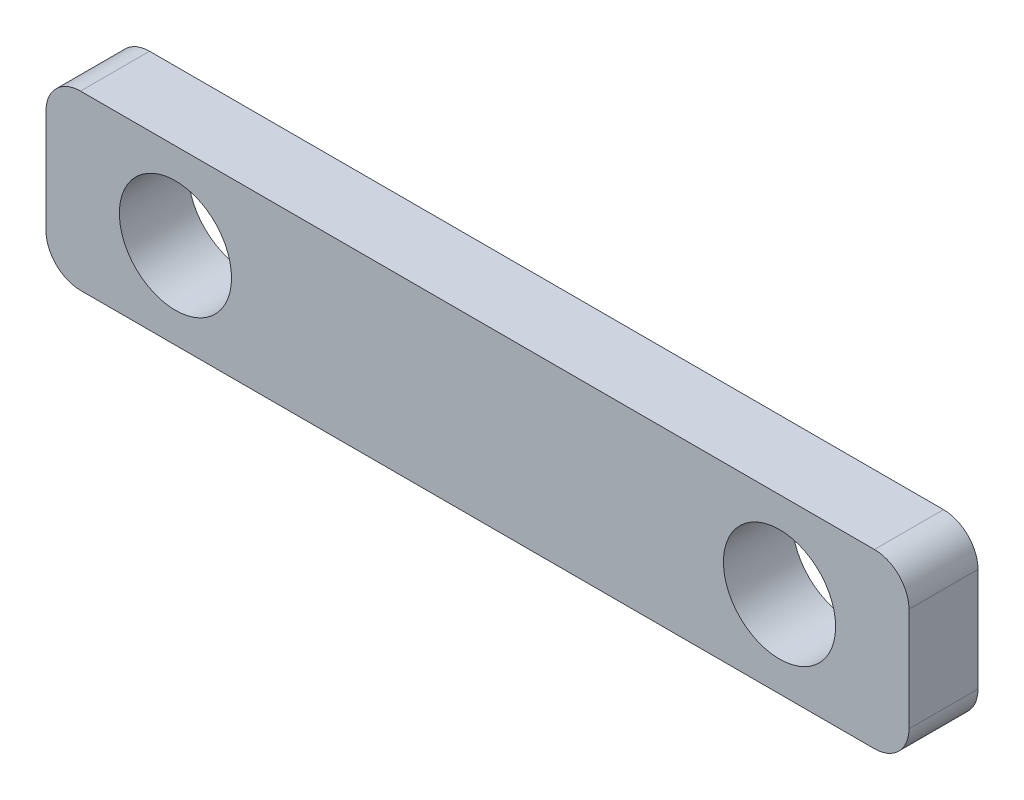
ISO-10303-21;
HEADER;
FILE_DESCRIPTION(('STEP AP214'),'2;1');
FILE_NAME('part.step','',(''),(''),'','','');
FILE_SCHEMA(('AUTOMOTIVE_DESIGN { 1 0 10303 214 1 1 1 1 }'));
ENDSEC;
DATA;
#1=APPLICATION_CONTEXT('core data for automotive mechanical design processes');
#2=APPLICATION_PROTOCOL_DEFINITION('international standard','automotive_design',2000,#1);
#3=PRODUCT_CONTEXT('',#1,'mechanical');
#4=PRODUCT('Part','Part','',(#3));
#5=PRODUCT_RELATED_PRODUCT_CATEGORY('part','',(#4));
#6=PRODUCT_DEFINITION_FORMATION('','',#4);
#7=PRODUCT_DEFINITION_CONTEXT('part definition',#1,'design');
#8=PRODUCT_DEFINITION('design','',#6,#7);
#9=PRODUCT_DEFINITION_SHAPE('','',#8);
#10=(LENGTH_UNIT() NAMED_UNIT(*) SI_UNIT(.MILLI.,.METRE.));
#11=(NAMED_UNIT(*) PLANE_ANGLE_UNIT() SI_UNIT($,.RADIAN.));
#12=(NAMED_UNIT(*) SI_UNIT($,.STERADIAN.) SOLID_ANGLE_UNIT());
#13=UNCERTAINTY_MEASURE_WITH_UNIT(LENGTH_MEASURE(1.E-05),#10,'distance_accuracy_value','');
#14=(GEOMETRIC_REPRESENTATION_CONTEXT(3) GLOBAL_UNCERTAINTY_ASSIGNED_CONTEXT((#13)) GLOBAL_UNIT_ASSIGNED_CONTEXT((#10,
#11,#12)) REPRESENTATION_CONTEXT('',''));
#15=CARTESIAN_POINT('',(0.,0.,0.));
#16=DIRECTION('',(0.,0.,1.));
#17=DIRECTION('',(1.,0.,0.));
#18=AXIS2_PLACEMENT_3D('',#15,#16,#17);
#19=CARTESIAN_POINT('',(0.,0.,4.));
#20=DIRECTION('',(0.,0.,-1.));
#21=DIRECTION('',(-1.,0.,0.));
#22=AXIS2_PLACEMENT_3D('',#19,#20,#21);
#23=PLANE('',#22);
#24=CARTESIAN_POINT('',(17.5,0.,4.));
#25=DIRECTION('',(0.,0.,1.));
#26=DIRECTION('',(1.,0.,0.));
#27=AXIS2_PLACEMENT_3D('',#24,#25,#26);
#28=CIRCLE('',#27,3.25);
#29=CARTESIAN_POINT('',(20.75,0.,4.));
#30=VERTEX_POINT('',#29);
#31=EDGE_CURVE('E127',#30,#30,#28,.T.);
#32=ORIENTED_EDGE('',*,*,#31,.F.);
#33=EDGE_LOOP('',(#32));
#34=FACE_BOUND('',#33,.T.);
#35=DIRECTION('',(-1.,0.,0.));
#36=VECTOR('',#35,1.);
#37=CARTESIAN_POINT('',(-25.,5.,4.));
#38=LINE('',#37,#36);
#39=CARTESIAN_POINT('',(23.,5.,4.));
#40=VERTEX_POINT('',#39);
#41=CARTESIAN_POINT('',(-23.,5.,4.));
#42=VERTEX_POINT('',#41);
#43=EDGE_CURVE('E136',#40,#42,#38,.T.);
#44=ORIENTED_EDGE('',*,*,#43,.T.);
#45=CARTESIAN_POINT('',(-23.,3.,4.));
#46=DIRECTION('',(0.,0.,-1.));
#47=DIRECTION('',(-1.,0.,0.));
#48=AXIS2_PLACEMENT_3D('',#45,#46,#47);
#49=CIRCLE('',#48,2.);
#50=CARTESIAN_POINT('',(-25.,3.,4.));
#51=VERTEX_POINT('',#50);
#52=EDGE_CURVE('E155',#42,#51,#49,.F.);
#53=ORIENTED_EDGE('',*,*,#52,.T.);
#54=DIRECTION('',(0.,-1.,0.));
#55=VECTOR('',#54,1.);
#56=CARTESIAN_POINT('',(-25.,-5.,4.));
#57=LINE('',#56,#55);
#58=CARTESIAN_POINT('',(-25.,-3.,4.));
#59=VERTEX_POINT('',#58);
#60=EDGE_CURVE('E119',#51,#59,#57,.T.);
#61=ORIENTED_EDGE('',*,*,#60,.T.);
#62=CARTESIAN_POINT('',(-23.,-3.,4.));
#63=DIRECTION('',(0.,0.,-1.));
#64=DIRECTION('',(-1.,0.,0.));
#65=AXIS2_PLACEMENT_3D('',#62,#63,#64);
#66=CIRCLE('',#65,2.);
#67=CARTESIAN_POINT('',(-23.,-5.,4.));
#68=VERTEX_POINT('',#67);
#69=EDGE_CURVE('E150',#59,#68,#66,.F.);
#70=ORIENTED_EDGE('',*,*,#69,.T.);
#71=DIRECTION('',(1.,0.,0.));
#72=VECTOR('',#71,1.);
#73=CARTESIAN_POINT('',(-25.,-5.,4.));
#74=LINE('',#73,#72);
#75=CARTESIAN_POINT('',(23.,-5.,4.));
#76=VERTEX_POINT('',#75);
#77=EDGE_CURVE('E166',#68,#76,#74,.T.);
#78=ORIENTED_EDGE('',*,*,#77,.T.);
#79=CARTESIAN_POINT('',(23.,-3.,4.));
#80=DIRECTION('',(0.,0.,-1.));
#81=DIRECTION('',(-1.,0.,0.));
#82=AXIS2_PLACEMENT_3D('',#79,#80,#81);
#83=CIRCLE('',#82,2.);
#84=CARTESIAN_POINT('',(25.,-3.,4.));
#85=VERTEX_POINT('',#84);
#86=EDGE_CURVE('E55',#76,#85,#83,.F.);
#87=ORIENTED_EDGE('',*,*,#86,.T.);
#88=DIRECTION('',(0.,1.,0.));
#89=VECTOR('',#88,1.);
#90=CARTESIAN_POINT('',(25.,-5.,4.));
#91=LINE('',#90,#89);
#92=CARTESIAN_POINT('',(25.,3.,4.));
#93=VERTEX_POINT('',#92);
#94=EDGE_CURVE('E174',#85,#93,#91,.T.);
#95=ORIENTED_EDGE('',*,*,#94,.T.);
#96=CARTESIAN_POINT('',(23.,3.,4.));
#97=DIRECTION('',(0.,0.,-1.));
#98=DIRECTION('',(-1.,0.,0.));
#99=AXIS2_PLACEMENT_3D('',#96,#97,#98);
#100=CIRCLE('',#99,2.);
#101=EDGE_CURVE('E153',#93,#40,#100,.F.);
#102=ORIENTED_EDGE('',*,*,#101,.T.);
#103=EDGE_LOOP('',(#44,#53,#61,#70,#78,#87,#95,#102));
#104=FACE_BOUND('',#103,.T.);
#105=CARTESIAN_POINT('',(-17.5,0.,4.));
#106=DIRECTION('',(0.,0.,1.));
#107=DIRECTION('',(1.,0.,0.));
#108=AXIS2_PLACEMENT_3D('',#105,#106,#107);
#109=CIRCLE('',#108,3.25);
#110=CARTESIAN_POINT('',(-14.25,0.,4.));
#111=VERTEX_POINT('',#110);
#112=EDGE_CURVE('E181',#111,#111,#109,.T.);
#113=ORIENTED_EDGE('',*,*,#112,.F.);
#114=EDGE_LOOP('',(#113));
#115=FACE_BOUND('',#114,.T.);
#116=ADVANCED_FACE('F33',(#34,#104,#115),#23,.F.);
#117=CARTESIAN_POINT('',(0.,0.,0.));
#118=DIRECTION('',(0.,0.,-1.));
#119=DIRECTION('',(-1.,0.,0.));
#120=AXIS2_PLACEMENT_3D('',#117,#118,#119);
#121=PLANE('',#120);
#122=CARTESIAN_POINT('',(17.5,0.,0.));
#123=DIRECTION('',(0.,0.,1.));
#124=DIRECTION('',(1.,0.,0.));
#125=AXIS2_PLACEMENT_3D('',#122,#123,#124);
#126=CIRCLE('',#125,3.25);
#127=CARTESIAN_POINT('',(20.75,0.,0.));
#128=VERTEX_POINT('',#127);
#129=EDGE_CURVE('E133',#128,#128,#126,.T.);
#130=ORIENTED_EDGE('',*,*,#129,.T.);
#131=EDGE_LOOP('',(#130));
#132=FACE_BOUND('',#131,.T.);
#133=DIRECTION('',(0.,-1.,0.));
#134=VECTOR('',#133,1.);
#135=CARTESIAN_POINT('',(-25.,-5.,0.));
#136=LINE('',#135,#134);
#137=CARTESIAN_POINT('',(-25.,3.,0.));
#138=VERTEX_POINT('',#137);
#139=CARTESIAN_POINT('',(-25.,-3.,0.));
#140=VERTEX_POINT('',#139);
#141=EDGE_CURVE('E116',#138,#140,#136,.T.);
#142=ORIENTED_EDGE('',*,*,#141,.F.);
#143=CARTESIAN_POINT('',(-23.,3.,0.));
#144=DIRECTION('',(0.,0.,-1.));
#145=DIRECTION('',(-1.,0.,0.));
#146=AXIS2_PLACEMENT_3D('',#143,#144,#145);
#147=CIRCLE('',#146,2.);
#148=CARTESIAN_POINT('',(-23.,5.,0.));
#149=VERTEX_POINT('',#148);
#150=EDGE_CURVE('E99',#138,#149,#147,.T.);
#151=ORIENTED_EDGE('',*,*,#150,.T.);
#152=DIRECTION('',(-1.,0.,0.));
#153=VECTOR('',#152,1.);
#154=CARTESIAN_POINT('',(-25.,5.,0.));
#155=LINE('',#154,#153);
#156=CARTESIAN_POINT('',(23.,5.,0.));
#157=VERTEX_POINT('',#156);
#158=EDGE_CURVE('E140',#157,#149,#155,.T.);
#159=ORIENTED_EDGE('',*,*,#158,.F.);
#160=CARTESIAN_POINT('',(23.,3.,0.));
#161=DIRECTION('',(0.,0.,-1.));
#162=DIRECTION('',(-1.,0.,0.));
#163=AXIS2_PLACEMENT_3D('',#160,#161,#162);
#164=CIRCLE('',#163,2.);
#165=CARTESIAN_POINT('',(25.,3.,0.));
#166=VERTEX_POINT('',#165);
#167=EDGE_CURVE('E110',#157,#166,#164,.T.);
#168=ORIENTED_EDGE('',*,*,#167,.T.);
#169=DIRECTION('',(0.,1.,0.));
#170=VECTOR('',#169,1.);
#171=CARTESIAN_POINT('',(25.,-5.,0.));
#172=LINE('',#171,#170);
#173=CARTESIAN_POINT('',(25.,-3.,0.));
#174=VERTEX_POINT('',#173);
#175=EDGE_CURVE('E130',#174,#166,#172,.T.);
#176=ORIENTED_EDGE('',*,*,#175,.F.);
#177=CARTESIAN_POINT('',(23.,-3.,0.));
#178=DIRECTION('',(0.,0.,-1.));
#179=DIRECTION('',(-1.,0.,0.));
#180=AXIS2_PLACEMENT_3D('',#177,#178,#179);
#181=CIRCLE('',#180,2.);
#182=CARTESIAN_POINT('',(23.,-5.,0.));
#183=VERTEX_POINT('',#182);
#184=EDGE_CURVE('E144',#174,#183,#181,.T.);
#185=ORIENTED_EDGE('',*,*,#184,.T.);
#186=DIRECTION('',(1.,0.,0.));
#187=VECTOR('',#186,1.);
#188=CARTESIAN_POINT('',(-25.,-5.,0.));
#189=LINE('',#188,#187);
#190=CARTESIAN_POINT('',(-23.,-5.,0.));
#191=VERTEX_POINT('',#190);
#192=EDGE_CURVE('E126',#191,#183,#189,.T.);
#193=ORIENTED_EDGE('',*,*,#192,.F.);
#194=CARTESIAN_POINT('',(-23.,-3.,0.));
#195=DIRECTION('',(0.,0.,-1.));
#196=DIRECTION('',(-1.,0.,0.));
#197=AXIS2_PLACEMENT_3D('',#194,#195,#196);
#198=CIRCLE('',#197,2.);
#199=EDGE_CURVE('E120',#191,#140,#198,.T.);
#200=ORIENTED_EDGE('',*,*,#199,.T.);
#201=EDGE_LOOP('',(#142,#151,#159,#168,#176,#185,#193,#200));
#202=FACE_BOUND('',#201,.T.);
#203=CARTESIAN_POINT('',(-17.5,0.,0.));
#204=DIRECTION('',(0.,0.,1.));
#205=DIRECTION('',(1.,0.,0.));
#206=AXIS2_PLACEMENT_3D('',#203,#204,#205);
#207=CIRCLE('',#206,3.25);
#208=CARTESIAN_POINT('',(-14.25,0.,0.));
#209=VERTEX_POINT('',#208);
#210=EDGE_CURVE('E183',#209,#209,#207,.T.);
#211=ORIENTED_EDGE('',*,*,#210,.T.);
#212=EDGE_LOOP('',(#211));
#213=FACE_BOUND('',#212,.T.);
#214=ADVANCED_FACE('F123',(#132,#202,#213),#121,.T.);
#215=CARTESIAN_POINT('',(-25.,-5.,4.));
#216=DIRECTION('',(1.,0.,0.));
#217=DIRECTION('',(0.,0.,-1.));
#218=AXIS2_PLACEMENT_3D('',#215,#216,#217);
#219=PLANE('',#218);
#220=ORIENTED_EDGE('',*,*,#60,.F.);
#221=DIRECTION('',(0.,0.,-1.));
#222=VECTOR('',#221,1.);
#223=CARTESIAN_POINT('',(-25.,3.,4.));
#224=LINE('',#223,#222);
#225=EDGE_CURVE('E103',#51,#138,#224,.T.);
#226=ORIENTED_EDGE('',*,*,#225,.T.);
#227=ORIENTED_EDGE('',*,*,#141,.T.);
#228=DIRECTION('',(0.,0.,-1.));
#229=VECTOR('',#228,1.);
#230=CARTESIAN_POINT('',(-25.,-3.,4.));
#231=LINE('',#230,#229);
#232=EDGE_CURVE('E121',#140,#59,#231,.F.);
#233=ORIENTED_EDGE('',*,*,#232,.T.);
#234=EDGE_LOOP('',(#220,#226,#227,#233));
#235=FACE_BOUND('',#234,.T.);
#236=ADVANCED_FACE('F115',(#235),#219,.F.);
#237=CARTESIAN_POINT('',(-25.,-5.,4.));
#238=DIRECTION('',(0.,1.,0.));
#239=DIRECTION('',(0.,0.,1.));
#240=AXIS2_PLACEMENT_3D('',#237,#238,#239);
#241=PLANE('',#240);
#242=ORIENTED_EDGE('',*,*,#192,.T.);
#243=DIRECTION('',(0.,0.,-1.));
#244=VECTOR('',#243,1.);
#245=CARTESIAN_POINT('',(23.,-5.,4.));
#246=LINE('',#245,#244);
#247=EDGE_CURVE('E11',#183,#76,#246,.F.);
#248=ORIENTED_EDGE('',*,*,#247,.T.);
#249=ORIENTED_EDGE('',*,*,#77,.F.);
#250=DIRECTION('',(0.,0.,-1.));
#251=VECTOR('',#250,1.);
#252=CARTESIAN_POINT('',(-23.,-5.,4.));
#253=LINE('',#252,#251);
#254=EDGE_CURVE('E41',#68,#191,#253,.T.);
#255=ORIENTED_EDGE('',*,*,#254,.T.);
#256=EDGE_LOOP('',(#242,#248,#249,#255));
#257=FACE_BOUND('',#256,.T.);
#258=ADVANCED_FACE('F164',(#257),#241,.F.);
#259=CARTESIAN_POINT('',(25.,-5.,4.));
#260=DIRECTION('',(-1.,0.,0.));
#261=DIRECTION('',(0.,0.,1.));
#262=AXIS2_PLACEMENT_3D('',#259,#260,#261);
#263=PLANE('',#262);
#264=ORIENTED_EDGE('',*,*,#175,.T.);
#265=DIRECTION('',(0.,0.,-1.));
#266=VECTOR('',#265,1.);
#267=CARTESIAN_POINT('',(25.,3.,4.));
#268=LINE('',#267,#266);
#269=EDGE_CURVE('E48',#166,#93,#268,.F.);
#270=ORIENTED_EDGE('',*,*,#269,.T.);
#271=ORIENTED_EDGE('',*,*,#94,.F.);
#272=DIRECTION('',(0.,0.,-1.));
#273=VECTOR('',#272,1.);
#274=CARTESIAN_POINT('',(25.,-3.,4.));
#275=LINE('',#274,#273);
#276=EDGE_CURVE('E157',#85,#174,#275,.T.);
#277=ORIENTED_EDGE('',*,*,#276,.T.);
#278=EDGE_LOOP('',(#264,#270,#271,#277));
#279=FACE_BOUND('',#278,.T.);
#280=ADVANCED_FACE('F173',(#279),#263,.F.);
#281=CARTESIAN_POINT('',(-25.,5.,4.));
#282=DIRECTION('',(0.,-1.,0.));
#283=DIRECTION('',(0.,0.,-1.));
#284=AXIS2_PLACEMENT_3D('',#281,#282,#283);
#285=PLANE('',#284);
#286=ORIENTED_EDGE('',*,*,#158,.T.);
#287=DIRECTION('',(0.,0.,-1.));
#288=VECTOR('',#287,1.);
#289=CARTESIAN_POINT('',(-23.,5.,4.));
#290=LINE('',#289,#288);
#291=EDGE_CURVE('E104',#149,#42,#290,.F.);
#292=ORIENTED_EDGE('',*,*,#291,.T.);
#293=ORIENTED_EDGE('',*,*,#43,.F.);
#294=DIRECTION('',(0.,0.,-1.));
#295=VECTOR('',#294,1.);
#296=CARTESIAN_POINT('',(23.,5.,4.));
#297=LINE('',#296,#295);
#298=EDGE_CURVE('E109',#40,#157,#297,.T.);
#299=ORIENTED_EDGE('',*,*,#298,.T.);
#300=EDGE_LOOP('',(#286,#292,#293,#299));
#301=FACE_BOUND('',#300,.T.);
#302=ADVANCED_FACE('F205',(#301),#285,.F.);
#303=CARTESIAN_POINT('',(17.5,0.,4.));
#304=DIRECTION('',(0.,0.,-1.));
#305=DIRECTION('',(-1.,0.,0.));
#306=AXIS2_PLACEMENT_3D('',#303,#304,#305);
#307=CYLINDRICAL_SURFACE('',#306,3.25);
#308=ORIENTED_EDGE('',*,*,#31,.T.);
#309=EDGE_LOOP('',(#308));
#310=FACE_BOUND('',#309,.T.);
#311=ORIENTED_EDGE('',*,*,#129,.F.);
#312=EDGE_LOOP('',(#311));
#313=FACE_BOUND('',#312,.T.);
#314=ADVANCED_FACE('F202',(#310,#313),#307,.F.);
#315=CARTESIAN_POINT('',(-17.5,0.,4.));
#316=DIRECTION('',(0.,0.,-1.));
#317=DIRECTION('',(-1.,0.,0.));
#318=AXIS2_PLACEMENT_3D('',#315,#316,#317);
#319=CYLINDRICAL_SURFACE('',#318,3.25);
#320=ORIENTED_EDGE('',*,*,#112,.T.);
#321=EDGE_LOOP('',(#320));
#322=FACE_BOUND('',#321,.T.);
#323=ORIENTED_EDGE('',*,*,#210,.F.);
#324=EDGE_LOOP('',(#323));
#325=FACE_BOUND('',#324,.T.);
#326=ADVANCED_FACE('F189',(#322,#325),#319,.F.);
#327=CARTESIAN_POINT('',(-23.,3.,4.));
#328=DIRECTION('',(0.,0.,-1.));
#329=DIRECTION('',(-1.,0.,0.));
#330=AXIS2_PLACEMENT_3D('',#327,#328,#329);
#331=CYLINDRICAL_SURFACE('',#330,2.);
#332=ORIENTED_EDGE('',*,*,#52,.F.);
#333=ORIENTED_EDGE('',*,*,#291,.F.);
#334=ORIENTED_EDGE('',*,*,#150,.F.);
#335=ORIENTED_EDGE('',*,*,#225,.F.);
#336=EDGE_LOOP('',(#332,#333,#334,#335));
#337=FACE_BOUND('',#336,.T.);
#338=ADVANCED_FACE('F102',(#337),#331,.T.);
#339=CARTESIAN_POINT('',(23.,3.,4.));
#340=DIRECTION('',(0.,0.,-1.));
#341=DIRECTION('',(-1.,0.,0.));
#342=AXIS2_PLACEMENT_3D('',#339,#340,#341);
#343=CYLINDRICAL_SURFACE('',#342,2.);
#344=ORIENTED_EDGE('',*,*,#101,.F.);
#345=ORIENTED_EDGE('',*,*,#269,.F.);
#346=ORIENTED_EDGE('',*,*,#167,.F.);
#347=ORIENTED_EDGE('',*,*,#298,.F.);
#348=EDGE_LOOP('',(#344,#345,#346,#347));
#349=FACE_BOUND('',#348,.T.);
#350=ADVANCED_FACE('F217',(#349),#343,.T.);
#351=CARTESIAN_POINT('',(23.,-3.,4.));
#352=DIRECTION('',(0.,0.,-1.));
#353=DIRECTION('',(-1.,0.,0.));
#354=AXIS2_PLACEMENT_3D('',#351,#352,#353);
#355=CYLINDRICAL_SURFACE('',#354,2.);
#356=ORIENTED_EDGE('',*,*,#86,.F.);
#357=ORIENTED_EDGE('',*,*,#247,.F.);
#358=ORIENTED_EDGE('',*,*,#184,.F.);
#359=ORIENTED_EDGE('',*,*,#276,.F.);
#360=EDGE_LOOP('',(#356,#357,#358,#359));
#361=FACE_BOUND('',#360,.T.);
#362=ADVANCED_FACE('F172',(#361),#355,.T.);
#363=CARTESIAN_POINT('',(-23.,-3.,4.));
#364=DIRECTION('',(0.,0.,-1.));
#365=DIRECTION('',(-1.,0.,0.));
#366=AXIS2_PLACEMENT_3D('',#363,#364,#365);
#367=CYLINDRICAL_SURFACE('',#366,2.);
#368=ORIENTED_EDGE('',*,*,#69,.F.);
#369=ORIENTED_EDGE('',*,*,#232,.F.);
#370=ORIENTED_EDGE('',*,*,#199,.F.);
#371=ORIENTED_EDGE('',*,*,#254,.F.);
#372=EDGE_LOOP('',(#368,#369,#370,#371));
#373=FACE_BOUND('',#372,.T.);
#374=ADVANCED_FACE('F35',(#373),#367,.T.);
#375=CLOSED_SHELL('',(#116,#214,#236,#258,#280,#302,#314,#326,#338,#350,#362,#374));
#376=MANIFOLD_SOLID_BREP('B2',#375);
#377=ADVANCED_BREP_SHAPE_REPRESENTATION('',(#18,#376),#14);
#378=SHAPE_DEFINITION_REPRESENTATION(#9,#377);
ENDSEC;
END-ISO-10303-21;
